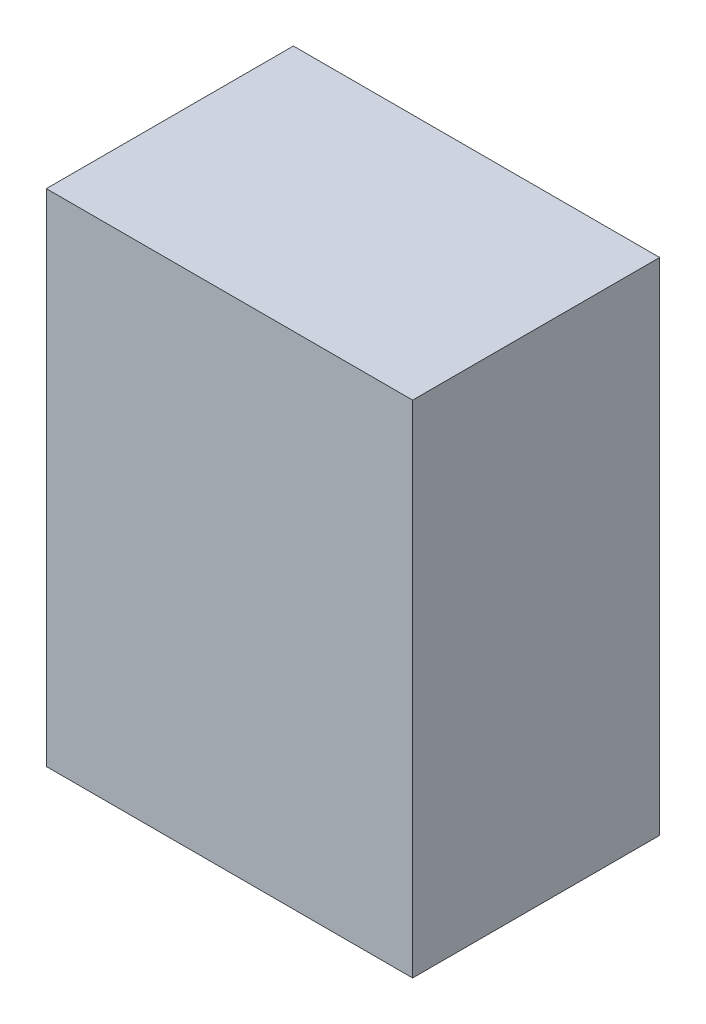
ISO-10303-21;
HEADER;
FILE_DESCRIPTION(('STEP AP214'),'2;1');
FILE_NAME('part.step','',(''),(''),'','','');
FILE_SCHEMA(('AUTOMOTIVE_DESIGN { 1 0 10303 214 1 1 1 1 }'));
ENDSEC;
DATA;
#1=APPLICATION_CONTEXT('core data for automotive mechanical design processes');
#2=APPLICATION_PROTOCOL_DEFINITION('international standard','automotive_design',2000,#1);
#3=PRODUCT_CONTEXT('',#1,'mechanical');
#4=PRODUCT('Part','Part','',(#3));
#5=PRODUCT_RELATED_PRODUCT_CATEGORY('part','',(#4));
#6=PRODUCT_DEFINITION_FORMATION('','',#4);
#7=PRODUCT_DEFINITION_CONTEXT('part definition',#1,'design');
#8=PRODUCT_DEFINITION('design','',#6,#7);
#9=PRODUCT_DEFINITION_SHAPE('','',#8);
#10=(LENGTH_UNIT() NAMED_UNIT(*) SI_UNIT(.MILLI.,.METRE.));
#11=(NAMED_UNIT(*) PLANE_ANGLE_UNIT() SI_UNIT($,.RADIAN.));
#12=(NAMED_UNIT(*) SI_UNIT($,.STERADIAN.) SOLID_ANGLE_UNIT());
#13=UNCERTAINTY_MEASURE_WITH_UNIT(LENGTH_MEASURE(1.E-05),#10,'distance_accuracy_value','');
#14=(GEOMETRIC_REPRESENTATION_CONTEXT(3) GLOBAL_UNCERTAINTY_ASSIGNED_CONTEXT((#13)) GLOBAL_UNIT_ASSIGNED_CONTEXT((#10,
#11,#12)) REPRESENTATION_CONTEXT('',''));
#15=CARTESIAN_POINT('',(0.,0.,0.));
#16=DIRECTION('',(0.,0.,1.));
#17=DIRECTION('',(1.,0.,0.));
#18=AXIS2_PLACEMENT_3D('',#15,#16,#17);
#19=CARTESIAN_POINT('',(-86.0000000000004,235.,57.9999999509995));
#20=DIRECTION('',(1.,0.,0.));
#21=DIRECTION('',(0.,0.,-1.));
#22=AXIS2_PLACEMENT_3D('',#19,#20,#21);
#23=PLANE('',#22);
#24=DIRECTION('',(0.,0.,1.));
#25=VECTOR('',#24,1.);
#26=CARTESIAN_POINT('',(-86.0000000000004,0.,57.9999999509995));
#27=LINE('',#26,#25);
#28=CARTESIAN_POINT('',(-86.0000000000004,0.,-57.9999999510006));
#29=VERTEX_POINT('',#28);
#30=CARTESIAN_POINT('',(-86.0000000000004,0.,57.9999999509995));
#31=VERTEX_POINT('',#30);
#32=EDGE_CURVE('E104',#29,#31,#27,.T.);
#33=ORIENTED_EDGE('',*,*,#32,.T.);
#34=DIRECTION('',(0.,-1.,0.));
#35=VECTOR('',#34,1.);
#36=CARTESIAN_POINT('',(-86.0000000000004,235.,57.9999999509995));
#37=LINE('',#36,#35);
#38=CARTESIAN_POINT('',(-86.0000000000004,235.,57.9999999509995));
#39=VERTEX_POINT('',#38);
#40=EDGE_CURVE('E11',#39,#31,#37,.T.);
#41=ORIENTED_EDGE('',*,*,#40,.F.);
#42=DIRECTION('',(0.,0.,1.));
#43=VECTOR('',#42,1.);
#44=CARTESIAN_POINT('',(-86.0000000000004,235.,57.9999999509995));
#45=LINE('',#44,#43);
#46=CARTESIAN_POINT('',(-86.0000000000004,235.,-57.9999999510006));
#47=VERTEX_POINT('',#46);
#48=EDGE_CURVE('E92',#47,#39,#45,.T.);
#49=ORIENTED_EDGE('',*,*,#48,.F.);
#50=DIRECTION('',(0.,-1.,0.));
#51=VECTOR('',#50,1.);
#52=CARTESIAN_POINT('',(-86.0000000000004,235.,-57.9999999510006));
#53=LINE('',#52,#51);
#54=EDGE_CURVE('E100',#47,#29,#53,.T.);
#55=ORIENTED_EDGE('',*,*,#54,.T.);
#56=EDGE_LOOP('',(#33,#41,#49,#55));
#57=FACE_BOUND('',#56,.T.);
#58=ADVANCED_FACE('F41',(#57),#23,.F.);
#59=CARTESIAN_POINT('',(85.9999999999995,235.,57.9999999509995));
#60=DIRECTION('',(0.,0.,-1.));
#61=DIRECTION('',(-1.,0.,0.));
#62=AXIS2_PLACEMENT_3D('',#59,#60,#61);
#63=PLANE('',#62);
#64=DIRECTION('',(1.,0.,0.));
#65=VECTOR('',#64,1.);
#66=CARTESIAN_POINT('',(85.9999999999995,0.,57.9999999509995));
#67=LINE('',#66,#65);
#68=CARTESIAN_POINT('',(85.9999999999995,0.,57.9999999509995));
#69=VERTEX_POINT('',#68);
#70=EDGE_CURVE('E96',#31,#69,#67,.T.);
#71=ORIENTED_EDGE('',*,*,#70,.T.);
#72=DIRECTION('',(0.,-1.,0.));
#73=VECTOR('',#72,1.);
#74=CARTESIAN_POINT('',(85.9999999999995,235.,57.9999999509995));
#75=LINE('',#74,#73);
#76=CARTESIAN_POINT('',(85.9999999999995,235.,57.9999999509995));
#77=VERTEX_POINT('',#76);
#78=EDGE_CURVE('E49',#77,#69,#75,.T.);
#79=ORIENTED_EDGE('',*,*,#78,.F.);
#80=DIRECTION('',(1.,0.,0.));
#81=VECTOR('',#80,1.);
#82=CARTESIAN_POINT('',(85.9999999999995,235.,57.9999999509995));
#83=LINE('',#82,#81);
#84=EDGE_CURVE('E87',#39,#77,#83,.T.);
#85=ORIENTED_EDGE('',*,*,#84,.F.);
#86=ORIENTED_EDGE('',*,*,#40,.T.);
#87=EDGE_LOOP('',(#71,#79,#85,#86));
#88=FACE_BOUND('',#87,.T.);
#89=ADVANCED_FACE('F95',(#88),#63,.F.);
#90=CARTESIAN_POINT('',(85.9999999999995,235.,57.9999999509995));
#91=DIRECTION('',(-1.,0.,0.));
#92=DIRECTION('',(0.,0.,1.));
#93=AXIS2_PLACEMENT_3D('',#90,#91,#92);
#94=PLANE('',#93);
#95=DIRECTION('',(0.,0.,-1.));
#96=VECTOR('',#95,1.);
#97=CARTESIAN_POINT('',(85.9999999999995,0.,57.9999999509995));
#98=LINE('',#97,#96);
#99=CARTESIAN_POINT('',(85.9999999999995,0.,-57.9999999510006));
#100=VERTEX_POINT('',#99);
#101=EDGE_CURVE('E74',#69,#100,#98,.T.);
#102=ORIENTED_EDGE('',*,*,#101,.T.);
#103=DIRECTION('',(0.,-1.,0.));
#104=VECTOR('',#103,1.);
#105=CARTESIAN_POINT('',(85.9999999999995,235.,-57.9999999510006));
#106=LINE('',#105,#104);
#107=CARTESIAN_POINT('',(85.9999999999995,235.,-57.9999999510006));
#108=VERTEX_POINT('',#107);
#109=EDGE_CURVE('E97',#108,#100,#106,.T.);
#110=ORIENTED_EDGE('',*,*,#109,.F.);
#111=DIRECTION('',(0.,0.,-1.));
#112=VECTOR('',#111,1.);
#113=CARTESIAN_POINT('',(85.9999999999995,235.,57.9999999509995));
#114=LINE('',#113,#112);
#115=EDGE_CURVE('E90',#77,#108,#114,.T.);
#116=ORIENTED_EDGE('',*,*,#115,.F.);
#117=ORIENTED_EDGE('',*,*,#78,.T.);
#118=EDGE_LOOP('',(#102,#110,#116,#117));
#119=FACE_BOUND('',#118,.T.);
#120=ADVANCED_FACE('F98',(#119),#94,.F.);
#121=CARTESIAN_POINT('',(85.9999999999995,235.,-57.9999999510006));
#122=DIRECTION('',(0.,0.,1.));
#123=DIRECTION('',(1.,0.,0.));
#124=AXIS2_PLACEMENT_3D('',#121,#122,#123);
#125=PLANE('',#124);
#126=DIRECTION('',(-1.,0.,0.));
#127=VECTOR('',#126,1.);
#128=CARTESIAN_POINT('',(85.9999999999995,0.,-57.9999999510006));
#129=LINE('',#128,#127);
#130=EDGE_CURVE('E80',#100,#29,#129,.T.);
#131=ORIENTED_EDGE('',*,*,#130,.T.);
#132=ORIENTED_EDGE('',*,*,#54,.F.);
#133=DIRECTION('',(-1.,0.,0.));
#134=VECTOR('',#133,1.);
#135=CARTESIAN_POINT('',(85.9999999999995,235.,-57.9999999510006));
#136=LINE('',#135,#134);
#137=EDGE_CURVE('E57',#108,#47,#136,.T.);
#138=ORIENTED_EDGE('',*,*,#137,.F.);
#139=ORIENTED_EDGE('',*,*,#109,.T.);
#140=EDGE_LOOP('',(#131,#132,#138,#139));
#141=FACE_BOUND('',#140,.T.);
#142=ADVANCED_FACE('F111',(#141),#125,.F.);
#143=CARTESIAN_POINT('',(0.,235.,0.));
#144=DIRECTION('',(0.,1.,0.));
#145=DIRECTION('',(0.,0.,1.));
#146=AXIS2_PLACEMENT_3D('',#143,#144,#145);
#147=PLANE('',#146);
#148=ORIENTED_EDGE('',*,*,#48,.T.);
#149=ORIENTED_EDGE('',*,*,#84,.T.);
#150=ORIENTED_EDGE('',*,*,#115,.T.);
#151=ORIENTED_EDGE('',*,*,#137,.T.);
#152=EDGE_LOOP('',(#148,#149,#150,#151));
#153=FACE_BOUND('',#152,.T.);
#154=ADVANCED_FACE('F88',(#153),#147,.T.);
#155=CARTESIAN_POINT('',(0.,0.,0.));
#156=DIRECTION('',(0.,1.,0.));
#157=DIRECTION('',(0.,0.,1.));
#158=AXIS2_PLACEMENT_3D('',#155,#156,#157);
#159=PLANE('',#158);
#160=ORIENTED_EDGE('',*,*,#32,.F.);
#161=ORIENTED_EDGE('',*,*,#130,.F.);
#162=ORIENTED_EDGE('',*,*,#101,.F.);
#163=ORIENTED_EDGE('',*,*,#70,.F.);
#164=EDGE_LOOP('',(#160,#161,#162,#163));
#165=FACE_BOUND('',#164,.T.);
#166=ADVANCED_FACE('F114',(#165),#159,.F.);
#167=CLOSED_SHELL('',(#58,#89,#120,#142,#154,#166));
#168=MANIFOLD_SOLID_BREP('B2',#167);
#169=ADVANCED_BREP_SHAPE_REPRESENTATION('',(#18,#168),#14);
#170=SHAPE_DEFINITION_REPRESENTATION(#9,#169);
ENDSEC;
END-ISO-10303-21;
